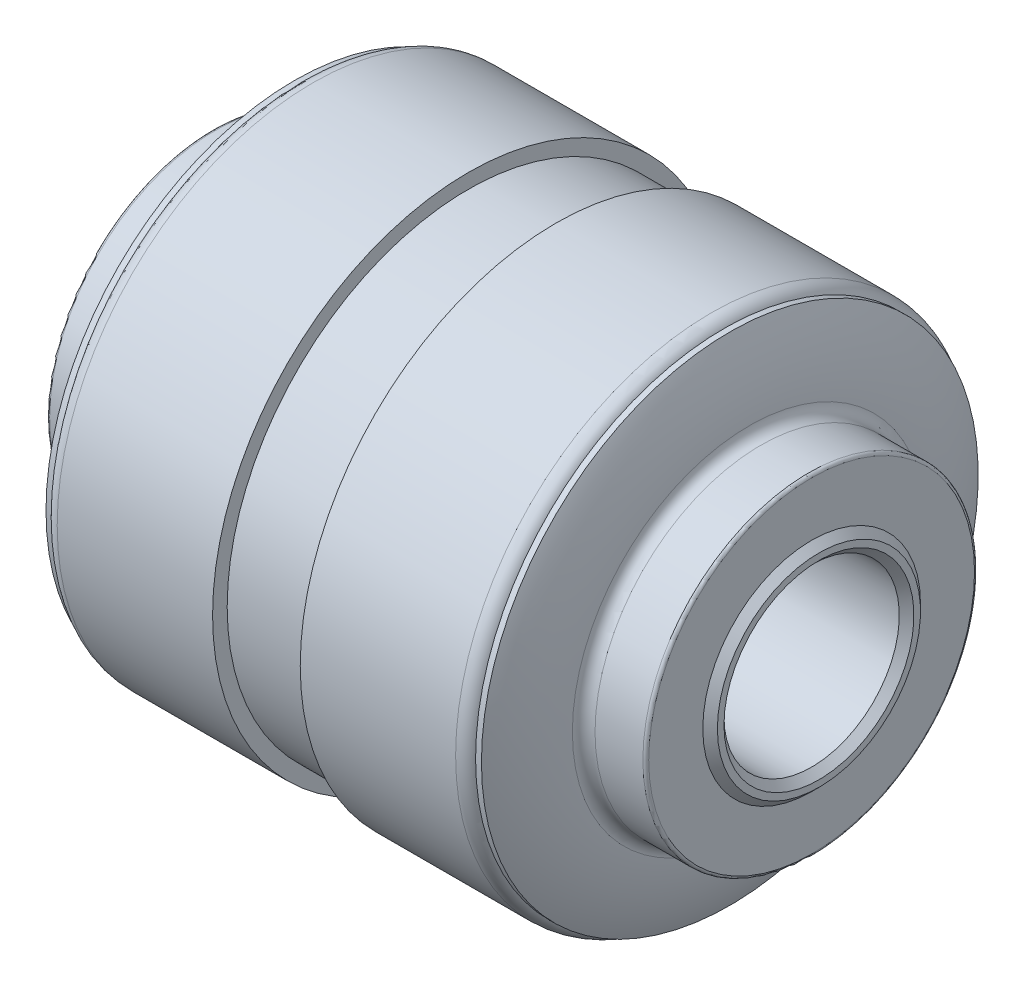
ISO-10303-21;
HEADER;
FILE_DESCRIPTION(('STEP AP214'),'2;1');
FILE_NAME('part.step','',(''),(''),'','','');
FILE_SCHEMA(('AUTOMOTIVE_DESIGN { 1 0 10303 214 1 1 1 1 }'));
ENDSEC;
DATA;
#1=APPLICATION_CONTEXT('core data for automotive mechanical design processes');
#2=APPLICATION_PROTOCOL_DEFINITION('international standard','automotive_design',2000,#1);
#3=PRODUCT_CONTEXT('',#1,'mechanical');
#4=PRODUCT('Part','Part','',(#3));
#5=PRODUCT_RELATED_PRODUCT_CATEGORY('part','',(#4));
#6=PRODUCT_DEFINITION_FORMATION('','',#4);
#7=PRODUCT_DEFINITION_CONTEXT('part definition',#1,'design');
#8=PRODUCT_DEFINITION('design','',#6,#7);
#9=PRODUCT_DEFINITION_SHAPE('','',#8);
#10=(LENGTH_UNIT() NAMED_UNIT(*) SI_UNIT(.MILLI.,.METRE.));
#11=(NAMED_UNIT(*) PLANE_ANGLE_UNIT() SI_UNIT($,.RADIAN.));
#12=(NAMED_UNIT(*) SI_UNIT($,.STERADIAN.) SOLID_ANGLE_UNIT());
#13=UNCERTAINTY_MEASURE_WITH_UNIT(LENGTH_MEASURE(1.E-05),#10,'distance_accuracy_value','');
#14=(GEOMETRIC_REPRESENTATION_CONTEXT(3) GLOBAL_UNCERTAINTY_ASSIGNED_CONTEXT((#13)) GLOBAL_UNIT_ASSIGNED_CONTEXT((#10,
#11,#12)) REPRESENTATION_CONTEXT('',''));
#15=CARTESIAN_POINT('',(0.,0.,0.));
#16=DIRECTION('',(0.,0.,1.));
#17=DIRECTION('',(1.,0.,0.));
#18=AXIS2_PLACEMENT_3D('',#15,#16,#17);
#19=CARTESIAN_POINT('',(88.99,0.,0.));
#20=DIRECTION('',(1.,0.,0.));
#21=DIRECTION('',(0.,0.,1.));
#22=AXIS2_PLACEMENT_3D('',#19,#20,#21);
#23=CYLINDRICAL_SURFACE('',#22,17.);
#24=CARTESIAN_POINT('',(-14.5,0.,0.));
#25=DIRECTION('',(-1.,0.,0.));
#26=DIRECTION('',(0.,0.,1.));
#27=AXIS2_PLACEMENT_3D('',#24,#25,#26);
#28=CIRCLE('',#27,17.);
#29=CARTESIAN_POINT('',(-14.5,0.,17.));
#30=VERTEX_POINT('',#29);
#31=EDGE_CURVE('E111',#30,#30,#28,.T.);
#32=ORIENTED_EDGE('',*,*,#31,.T.);
#33=EDGE_LOOP('',(#32));
#34=FACE_BOUND('',#33,.T.);
#35=CARTESIAN_POINT('',(-14.9002242129923,0.,0.));
#36=DIRECTION('',(1.,0.,0.));
#37=DIRECTION('',(0.,0.,-1.));
#38=AXIS2_PLACEMENT_3D('',#35,#36,#37);
#39=CIRCLE('',#38,17.);
#40=CARTESIAN_POINT('',(-14.9002242129923,0.,-17.));
#41=VERTEX_POINT('',#40);
#42=EDGE_CURVE('E90',#41,#41,#39,.F.);
#43=ORIENTED_EDGE('',*,*,#42,.F.);
#44=EDGE_LOOP('',(#43));
#45=FACE_BOUND('',#44,.T.);
#46=ADVANCED_FACE('F33',(#34,#45),#23,.T.);
#47=CARTESIAN_POINT('',(-88.99,0.,0.));
#48=DIRECTION('',(-1.,0.,0.));
#49=DIRECTION('',(0.,0.,1.));
#50=AXIS2_PLACEMENT_3D('',#47,#48,#49);
#51=CYLINDRICAL_SURFACE('',#50,17.);
#52=CARTESIAN_POINT('',(14.5,0.,0.));
#53=DIRECTION('',(-1.,0.,0.));
#54=DIRECTION('',(0.,0.,1.));
#55=AXIS2_PLACEMENT_3D('',#52,#53,#54);
#56=CIRCLE('',#55,17.);
#57=CARTESIAN_POINT('',(14.5,0.,17.));
#58=VERTEX_POINT('',#57);
#59=EDGE_CURVE('E101',#58,#58,#56,.T.);
#60=ORIENTED_EDGE('',*,*,#59,.F.);
#61=EDGE_LOOP('',(#60));
#62=FACE_BOUND('',#61,.T.);
#63=CARTESIAN_POINT('',(14.9002242129923,0.,0.));
#64=DIRECTION('',(-1.,0.,0.));
#65=DIRECTION('',(0.,0.,1.));
#66=AXIS2_PLACEMENT_3D('',#63,#64,#65);
#67=CIRCLE('',#66,17.);
#68=CARTESIAN_POINT('',(14.9002242129923,0.,17.));
#69=VERTEX_POINT('',#68);
#70=EDGE_CURVE('E94',#69,#69,#67,.F.);
#71=ORIENTED_EDGE('',*,*,#70,.F.);
#72=EDGE_LOOP('',(#71));
#73=FACE_BOUND('',#72,.T.);
#74=ADVANCED_FACE('F140',(#62,#73),#51,.T.);
#75=CARTESIAN_POINT('',(-88.99,0.,0.));
#76=DIRECTION('',(-1.,0.,0.));
#77=DIRECTION('',(0.,0.,1.));
#78=AXIS2_PLACEMENT_3D('',#75,#76,#77);
#79=CYLINDRICAL_SURFACE('',#78,6.);
#80=CARTESIAN_POINT('',(-20.5,0.,0.));
#81=DIRECTION('',(1.,0.,0.));
#82=DIRECTION('',(0.,0.,-1.));
#83=AXIS2_PLACEMENT_3D('',#80,#81,#82);
#84=CIRCLE('',#83,6.);
#85=CARTESIAN_POINT('',(-20.5,0.,-6.));
#86=VERTEX_POINT('',#85);
#87=EDGE_CURVE('E83',#86,#86,#84,.F.);
#88=ORIENTED_EDGE('',*,*,#87,.T.);
#89=EDGE_LOOP('',(#88));
#90=FACE_BOUND('',#89,.T.);
#91=CARTESIAN_POINT('',(20.5,0.,0.));
#92=DIRECTION('',(-1.,0.,0.));
#93=DIRECTION('',(0.,0.,1.));
#94=AXIS2_PLACEMENT_3D('',#91,#92,#93);
#95=CIRCLE('',#94,6.);
#96=CARTESIAN_POINT('',(20.5,0.,6.));
#97=VERTEX_POINT('',#96);
#98=EDGE_CURVE('E86',#97,#97,#95,.F.);
#99=ORIENTED_EDGE('',*,*,#98,.T.);
#100=EDGE_LOOP('',(#99));
#101=FACE_BOUND('',#100,.T.);
#102=ADVANCED_FACE('F146',(#90,#101),#79,.F.);
#103=CARTESIAN_POINT('',(21.,6.,0.));
#104=DIRECTION('',(-1.,0.,0.));
#105=DIRECTION('',(0.,0.,1.));
#106=AXIS2_PLACEMENT_3D('',#103,#104,#105);
#107=PLANE('',#106);
#108=CARTESIAN_POINT('',(21.,0.,0.));
#109=DIRECTION('',(-1.,0.,0.));
#110=DIRECTION('',(0.,0.,1.));
#111=AXIS2_PLACEMENT_3D('',#108,#109,#110);
#112=CIRCLE('',#111,6.49999999999999);
#113=CARTESIAN_POINT('',(21.,0.,6.49999999999999));
#114=VERTEX_POINT('',#113);
#115=EDGE_CURVE('E71',#114,#114,#112,.T.);
#116=ORIENTED_EDGE('',*,*,#115,.T.);
#117=EDGE_LOOP('',(#116));
#118=FACE_BOUND('',#117,.T.);
#119=CARTESIAN_POINT('',(21.,0.,0.));
#120=DIRECTION('',(-1.,0.,0.));
#121=DIRECTION('',(0.,0.,1.));
#122=AXIS2_PLACEMENT_3D('',#119,#120,#121);
#123=CIRCLE('',#122,6.94999999999999);
#124=CARTESIAN_POINT('',(21.,0.,6.94999999999999));
#125=VERTEX_POINT('',#124);
#126=EDGE_CURVE('E74',#125,#125,#123,.F.);
#127=ORIENTED_EDGE('',*,*,#126,.T.);
#128=EDGE_LOOP('',(#127));
#129=FACE_BOUND('',#128,.T.);
#130=ADVANCED_FACE('F321',(#118,#129),#107,.F.);
#131=CARTESIAN_POINT('',(20.5,7.45,0.));
#132=DIRECTION('',(-1.,0.,0.));
#133=DIRECTION('',(0.,0.,1.));
#134=AXIS2_PLACEMENT_3D('',#131,#132,#133);
#135=PLANE('',#134);
#136=CARTESIAN_POINT('',(20.5,0.,0.));
#137=DIRECTION('',(-1.,0.,0.));
#138=DIRECTION('',(0.,0.,1.));
#139=AXIS2_PLACEMENT_3D('',#136,#137,#138);
#140=CIRCLE('',#139,11.15);
#141=CARTESIAN_POINT('',(20.5,0.,11.15));
#142=VERTEX_POINT('',#141);
#143=EDGE_CURVE('E59',#142,#142,#140,.F.);
#144=ORIENTED_EDGE('',*,*,#143,.T.);
#145=EDGE_LOOP('',(#144));
#146=FACE_BOUND('',#145,.T.);
#147=CARTESIAN_POINT('',(20.5,0.,0.));
#148=DIRECTION('',(-1.,0.,0.));
#149=DIRECTION('',(0.,0.,1.));
#150=AXIS2_PLACEMENT_3D('',#147,#148,#149);
#151=CIRCLE('',#150,7.45);
#152=CARTESIAN_POINT('',(20.5,0.,7.45));
#153=VERTEX_POINT('',#152);
#154=EDGE_CURVE('E89',#153,#153,#151,.T.);
#155=ORIENTED_EDGE('',*,*,#154,.T.);
#156=EDGE_LOOP('',(#155));
#157=FACE_BOUND('',#156,.T.);
#158=ADVANCED_FACE('F293',(#146,#157),#135,.F.);
#159=CARTESIAN_POINT('',(-88.99,0.,0.));
#160=DIRECTION('',(-1.,0.,0.));
#161=DIRECTION('',(0.,0.,1.));
#162=AXIS2_PLACEMENT_3D('',#159,#160,#161);
#163=CYLINDRICAL_SURFACE('',#162,11.35);
#164=CARTESIAN_POINT('',(17.0259180473517,0.,0.));
#165=DIRECTION('',(-1.,0.,0.));
#166=DIRECTION('',(0.,0.,1.));
#167=AXIS2_PLACEMENT_3D('',#164,#165,#166);
#168=CIRCLE('',#167,11.35);
#169=CARTESIAN_POINT('',(17.0259180473517,0.,11.35));
#170=VERTEX_POINT('',#169);
#171=EDGE_CURVE('E44',#170,#170,#168,.F.);
#172=ORIENTED_EDGE('',*,*,#171,.T.);
#173=EDGE_LOOP('',(#172));
#174=FACE_BOUND('',#173,.T.);
#175=CARTESIAN_POINT('',(20.3,0.,0.));
#176=DIRECTION('',(-1.,0.,0.));
#177=DIRECTION('',(0.,0.,1.));
#178=AXIS2_PLACEMENT_3D('',#175,#176,#177);
#179=CIRCLE('',#178,11.35);
#180=CARTESIAN_POINT('',(20.3,0.,11.35));
#181=VERTEX_POINT('',#180);
#182=EDGE_CURVE('E62',#181,#181,#179,.T.);
#183=ORIENTED_EDGE('',*,*,#182,.T.);
#184=EDGE_LOOP('',(#183));
#185=FACE_BOUND('',#184,.T.);
#186=ADVANCED_FACE('F246',(#174,#185),#163,.T.);
#187=CARTESIAN_POINT('',(-88.99,0.,0.));
#188=DIRECTION('',(-1.,0.,0.));
#189=DIRECTION('',(0.,0.,1.));
#190=AXIS2_PLACEMENT_3D('',#187,#188,#189);
#191=CYLINDRICAL_SURFACE('',#190,17.5);
#192=CARTESIAN_POINT('',(13.6339745962156,0.,0.));
#193=DIRECTION('',(1.,0.,0.));
#194=DIRECTION('',(0.,0.,-1.));
#195=AXIS2_PLACEMENT_3D('',#192,#193,#194);
#196=CIRCLE('',#195,17.5);
#197=CARTESIAN_POINT('',(13.6339745962156,0.,-17.5));
#198=VERTEX_POINT('',#197);
#199=EDGE_CURVE('E40',#198,#198,#196,.F.);
#200=ORIENTED_EDGE('',*,*,#199,.T.);
#201=EDGE_LOOP('',(#200));
#202=FACE_BOUND('',#201,.T.);
#203=CARTESIAN_POINT('',(3.,0.,0.));
#204=DIRECTION('',(-1.,0.,0.));
#205=DIRECTION('',(0.,0.,1.));
#206=AXIS2_PLACEMENT_3D('',#203,#204,#205);
#207=CIRCLE('',#206,17.5);
#208=CARTESIAN_POINT('',(3.,0.,17.5));
#209=VERTEX_POINT('',#208);
#210=EDGE_CURVE('E104',#209,#209,#207,.T.);
#211=ORIENTED_EDGE('',*,*,#210,.F.);
#212=EDGE_LOOP('',(#211));
#213=FACE_BOUND('',#212,.T.);
#214=ADVANCED_FACE('F136',(#202,#213),#191,.T.);
#215=CARTESIAN_POINT('',(3.,17.5,0.));
#216=DIRECTION('',(1.,0.,0.));
#217=DIRECTION('',(0.,0.,-1.));
#218=AXIS2_PLACEMENT_3D('',#215,#216,#217);
#219=PLANE('',#218);
#220=CARTESIAN_POINT('',(3.,0.,0.));
#221=DIRECTION('',(-1.,0.,0.));
#222=DIRECTION('',(0.,0.,1.));
#223=AXIS2_PLACEMENT_3D('',#220,#221,#222);
#224=CIRCLE('',#223,16.5);
#225=CARTESIAN_POINT('',(3.,0.,16.5));
#226=VERTEX_POINT('',#225);
#227=EDGE_CURVE('E97',#226,#226,#224,.T.);
#228=ORIENTED_EDGE('',*,*,#227,.F.);
#229=EDGE_LOOP('',(#228));
#230=FACE_BOUND('',#229,.T.);
#231=ORIENTED_EDGE('',*,*,#210,.T.);
#232=EDGE_LOOP('',(#231));
#233=FACE_BOUND('',#232,.T.);
#234=ADVANCED_FACE('F126',(#230,#233),#219,.F.);
#235=CARTESIAN_POINT('',(-88.99,0.,0.));
#236=DIRECTION('',(-1.,0.,0.));
#237=DIRECTION('',(0.,0.,1.));
#238=AXIS2_PLACEMENT_3D('',#235,#236,#237);
#239=CYLINDRICAL_SURFACE('',#238,16.5);
#240=ORIENTED_EDGE('',*,*,#227,.T.);
#241=EDGE_LOOP('',(#240));
#242=FACE_BOUND('',#241,.T.);
#243=CARTESIAN_POINT('',(-3.,0.,0.));
#244=DIRECTION('',(-1.,0.,0.));
#245=DIRECTION('',(0.,0.,1.));
#246=AXIS2_PLACEMENT_3D('',#243,#244,#245);
#247=CIRCLE('',#246,16.5);
#248=CARTESIAN_POINT('',(-3.,0.,16.5));
#249=VERTEX_POINT('',#248);
#250=EDGE_CURVE('E93',#249,#249,#247,.T.);
#251=ORIENTED_EDGE('',*,*,#250,.F.);
#252=EDGE_LOOP('',(#251));
#253=FACE_BOUND('',#252,.T.);
#254=ADVANCED_FACE('F123',(#242,#253),#239,.T.);
#255=CARTESIAN_POINT('',(3.75,0.,0.));
#256=DIRECTION('',(-1.,0.,0.));
#257=DIRECTION('',(0.,0.,1.));
#258=AXIS2_PLACEMENT_3D('',#255,#256,#257);
#259=DEGENERATE_TOROIDAL_SURFACE('',#258,11.35,12.5,.T.);
#260=CARTESIAN_POINT('',(16.2273665858573,0.,0.));
#261=DIRECTION('',(-1.,0.,0.));
#262=DIRECTION('',(0.,0.,1.));
#263=AXIS2_PLACEMENT_3D('',#260,#261,#262);
#264=CIRCLE('',#263,12.1018796992481);
#265=CARTESIAN_POINT('',(16.2273665858573,0.,12.1018796992481));
#266=VERTEX_POINT('',#265);
#267=EDGE_CURVE('E48',#266,#266,#264,.T.);
#268=ORIENTED_EDGE('',*,*,#267,.T.);
#269=EDGE_LOOP('',(#268));
#270=FACE_BOUND('',#269,.T.);
#271=ORIENTED_EDGE('',*,*,#70,.T.);
#272=EDGE_LOOP('',(#271));
#273=FACE_BOUND('',#272,.T.);
#274=ADVANCED_FACE('F125',(#270,#273),#259,.T.);
#275=CARTESIAN_POINT('',(-21.,6.,0.));
#276=DIRECTION('',(1.,0.,0.));
#277=DIRECTION('',(0.,0.,1.));
#278=AXIS2_PLACEMENT_3D('',#275,#276,#277);
#279=PLANE('',#278);
#280=CARTESIAN_POINT('',(-21.,0.,0.));
#281=DIRECTION('',(1.,0.,0.));
#282=DIRECTION('',(0.,0.,-1.));
#283=AXIS2_PLACEMENT_3D('',#280,#281,#282);
#284=CIRCLE('',#283,6.5);
#285=CARTESIAN_POINT('',(-21.,0.,-6.5));
#286=VERTEX_POINT('',#285);
#287=EDGE_CURVE('E77',#286,#286,#284,.T.);
#288=ORIENTED_EDGE('',*,*,#287,.T.);
#289=EDGE_LOOP('',(#288));
#290=FACE_BOUND('',#289,.T.);
#291=CARTESIAN_POINT('',(-21.,0.,0.));
#292=DIRECTION('',(1.,0.,0.));
#293=DIRECTION('',(0.,0.,-1.));
#294=AXIS2_PLACEMENT_3D('',#291,#292,#293);
#295=CIRCLE('',#294,6.95);
#296=CARTESIAN_POINT('',(-21.,0.,-6.95));
#297=VERTEX_POINT('',#296);
#298=EDGE_CURVE('E80',#297,#297,#295,.F.);
#299=ORIENTED_EDGE('',*,*,#298,.T.);
#300=EDGE_LOOP('',(#299));
#301=FACE_BOUND('',#300,.T.);
#302=ADVANCED_FACE('F133',(#290,#301),#279,.F.);
#303=CARTESIAN_POINT('',(-20.5,7.45,0.));
#304=DIRECTION('',(1.,0.,0.));
#305=DIRECTION('',(0.,0.,1.));
#306=AXIS2_PLACEMENT_3D('',#303,#304,#305);
#307=PLANE('',#306);
#308=CARTESIAN_POINT('',(-20.5,0.,0.));
#309=DIRECTION('',(1.,0.,0.));
#310=DIRECTION('',(0.,0.,-1.));
#311=AXIS2_PLACEMENT_3D('',#308,#309,#310);
#312=CIRCLE('',#311,11.15);
#313=CARTESIAN_POINT('',(-20.5,0.,-11.15));
#314=VERTEX_POINT('',#313);
#315=EDGE_CURVE('E68',#314,#314,#312,.F.);
#316=ORIENTED_EDGE('',*,*,#315,.T.);
#317=EDGE_LOOP('',(#316));
#318=FACE_BOUND('',#317,.T.);
#319=CARTESIAN_POINT('',(-20.5,0.,0.));
#320=DIRECTION('',(-1.,0.,0.));
#321=DIRECTION('',(0.,0.,1.));
#322=AXIS2_PLACEMENT_3D('',#319,#320,#321);
#323=CIRCLE('',#322,7.45);
#324=CARTESIAN_POINT('',(-20.5,0.,7.45));
#325=VERTEX_POINT('',#324);
#326=EDGE_CURVE('E98',#325,#325,#323,.T.);
#327=ORIENTED_EDGE('',*,*,#326,.F.);
#328=EDGE_LOOP('',(#327));
#329=FACE_BOUND('',#328,.T.);
#330=ADVANCED_FACE('F157',(#318,#329),#307,.F.);
#331=CARTESIAN_POINT('',(88.99,0.,0.));
#332=DIRECTION('',(1.,0.,0.));
#333=DIRECTION('',(0.,0.,1.));
#334=AXIS2_PLACEMENT_3D('',#331,#332,#333);
#335=CYLINDRICAL_SURFACE('',#334,11.35);
#336=CARTESIAN_POINT('',(-17.0259180473517,0.,0.));
#337=DIRECTION('',(-1.,0.,0.));
#338=DIRECTION('',(0.,0.,1.));
#339=AXIS2_PLACEMENT_3D('',#336,#337,#338);
#340=CIRCLE('',#339,11.35);
#341=CARTESIAN_POINT('',(-17.0259180473517,0.,11.35));
#342=VERTEX_POINT('',#341);
#343=EDGE_CURVE('E56',#342,#342,#340,.T.);
#344=ORIENTED_EDGE('',*,*,#343,.T.);
#345=EDGE_LOOP('',(#344));
#346=FACE_BOUND('',#345,.T.);
#347=CARTESIAN_POINT('',(-20.3,0.,0.));
#348=DIRECTION('',(1.,0.,0.));
#349=DIRECTION('',(0.,0.,-1.));
#350=AXIS2_PLACEMENT_3D('',#347,#348,#349);
#351=CIRCLE('',#350,11.35);
#352=CARTESIAN_POINT('',(-20.3,0.,-11.35));
#353=VERTEX_POINT('',#352);
#354=EDGE_CURVE('E65',#353,#353,#351,.T.);
#355=ORIENTED_EDGE('',*,*,#354,.T.);
#356=EDGE_LOOP('',(#355));
#357=FACE_BOUND('',#356,.T.);
#358=ADVANCED_FACE('F154',(#346,#357),#335,.T.);
#359=CARTESIAN_POINT('',(88.99,0.,0.));
#360=DIRECTION('',(1.,0.,0.));
#361=DIRECTION('',(0.,0.,1.));
#362=AXIS2_PLACEMENT_3D('',#359,#360,#361);
#363=CYLINDRICAL_SURFACE('',#362,17.5);
#364=CARTESIAN_POINT('',(-13.6339745962156,0.,0.));
#365=DIRECTION('',(-1.,0.,0.));
#366=DIRECTION('',(0.,0.,1.));
#367=AXIS2_PLACEMENT_3D('',#364,#365,#366);
#368=CIRCLE('',#367,17.5);
#369=CARTESIAN_POINT('',(-13.6339745962156,0.,17.5));
#370=VERTEX_POINT('',#369);
#371=EDGE_CURVE('E11',#370,#370,#368,.F.);
#372=ORIENTED_EDGE('',*,*,#371,.T.);
#373=EDGE_LOOP('',(#372));
#374=FACE_BOUND('',#373,.T.);
#375=CARTESIAN_POINT('',(-3.,0.,0.));
#376=DIRECTION('',(-1.,0.,0.));
#377=DIRECTION('',(0.,0.,1.));
#378=AXIS2_PLACEMENT_3D('',#375,#376,#377);
#379=CIRCLE('',#378,17.5);
#380=CARTESIAN_POINT('',(-3.,0.,17.5));
#381=VERTEX_POINT('',#380);
#382=EDGE_CURVE('E114',#381,#381,#379,.T.);
#383=ORIENTED_EDGE('',*,*,#382,.T.);
#384=EDGE_LOOP('',(#383));
#385=FACE_BOUND('',#384,.T.);
#386=ADVANCED_FACE('F152',(#374,#385),#363,.T.);
#387=CARTESIAN_POINT('',(-3.,17.5,0.));
#388=DIRECTION('',(-1.,0.,0.));
#389=DIRECTION('',(0.,0.,-1.));
#390=AXIS2_PLACEMENT_3D('',#387,#388,#389);
#391=PLANE('',#390);
#392=ORIENTED_EDGE('',*,*,#250,.T.);
#393=EDGE_LOOP('',(#392));
#394=FACE_BOUND('',#393,.T.);
#395=ORIENTED_EDGE('',*,*,#382,.F.);
#396=EDGE_LOOP('',(#395));
#397=FACE_BOUND('',#396,.T.);
#398=ADVANCED_FACE('F120',(#394,#397),#391,.F.);
#399=CARTESIAN_POINT('',(-3.75,0.,0.));
#400=DIRECTION('',(1.,0.,0.));
#401=DIRECTION('',(0.,0.,1.));
#402=AXIS2_PLACEMENT_3D('',#399,#400,#401);
#403=DEGENERATE_TOROIDAL_SURFACE('',#402,11.35,12.5,.T.);
#404=CARTESIAN_POINT('',(-16.2273665858573,0.,0.));
#405=DIRECTION('',(1.,0.,0.));
#406=DIRECTION('',(0.,0.,-1.));
#407=AXIS2_PLACEMENT_3D('',#404,#405,#406);
#408=CIRCLE('',#407,12.1018796992481);
#409=CARTESIAN_POINT('',(-16.2273665858573,0.,-12.1018796992481));
#410=VERTEX_POINT('',#409);
#411=EDGE_CURVE('E53',#410,#410,#408,.T.);
#412=ORIENTED_EDGE('',*,*,#411,.T.);
#413=EDGE_LOOP('',(#412));
#414=FACE_BOUND('',#413,.T.);
#415=ORIENTED_EDGE('',*,*,#42,.T.);
#416=EDGE_LOOP('',(#415));
#417=FACE_BOUND('',#416,.T.);
#418=ADVANCED_FACE('F183',(#414,#417),#403,.T.);
#419=CARTESIAN_POINT('',(-20.5,0.,0.));
#420=DIRECTION('',(-1.,0.,0.));
#421=DIRECTION('',(0.,0.,1.));
#422=AXIS2_PLACEMENT_3D('',#419,#420,#421);
#423=CONICAL_SURFACE('',#422,6.,0.785398163397447);
#424=ORIENTED_EDGE('',*,*,#287,.F.);
#425=EDGE_LOOP('',(#424));
#426=FACE_BOUND('',#425,.T.);
#427=ORIENTED_EDGE('',*,*,#87,.F.);
#428=EDGE_LOOP('',(#427));
#429=FACE_BOUND('',#428,.T.);
#430=ADVANCED_FACE('F173',(#426,#429),#423,.F.);
#431=CARTESIAN_POINT('',(-21.,0.,0.));
#432=DIRECTION('',(1.,0.,0.));
#433=DIRECTION('',(0.,0.,-1.));
#434=AXIS2_PLACEMENT_3D('',#431,#432,#433);
#435=CONICAL_SURFACE('',#434,6.95,0.78539816339745);
#436=ORIENTED_EDGE('',*,*,#326,.T.);
#437=EDGE_LOOP('',(#436));
#438=FACE_BOUND('',#437,.T.);
#439=ORIENTED_EDGE('',*,*,#298,.F.);
#440=EDGE_LOOP('',(#439));
#441=FACE_BOUND('',#440,.T.);
#442=ADVANCED_FACE('F170',(#438,#441),#435,.T.);
#443=CARTESIAN_POINT('',(21.,0.,0.));
#444=DIRECTION('',(1.,0.,0.));
#445=DIRECTION('',(0.,0.,-1.));
#446=AXIS2_PLACEMENT_3D('',#443,#444,#445);
#447=CONICAL_SURFACE('',#446,6.5,0.785398163397446);
#448=ORIENTED_EDGE('',*,*,#98,.F.);
#449=EDGE_LOOP('',(#448));
#450=FACE_BOUND('',#449,.T.);
#451=ORIENTED_EDGE('',*,*,#115,.F.);
#452=EDGE_LOOP('',(#451));
#453=FACE_BOUND('',#452,.T.);
#454=ADVANCED_FACE('F172',(#450,#453),#447,.F.);
#455=CARTESIAN_POINT('',(20.5,0.,0.));
#456=DIRECTION('',(-1.,0.,0.));
#457=DIRECTION('',(0.,0.,1.));
#458=AXIS2_PLACEMENT_3D('',#455,#456,#457);
#459=CONICAL_SURFACE('',#458,7.45,0.78539816339745);
#460=ORIENTED_EDGE('',*,*,#126,.F.);
#461=EDGE_LOOP('',(#460));
#462=FACE_BOUND('',#461,.T.);
#463=ORIENTED_EDGE('',*,*,#154,.F.);
#464=EDGE_LOOP('',(#463));
#465=FACE_BOUND('',#464,.T.);
#466=ADVANCED_FACE('F180',(#462,#465),#459,.T.);
#467=CARTESIAN_POINT('',(-20.3,0.,0.));
#468=DIRECTION('',(1.,0.,0.));
#469=DIRECTION('',(0.,0.,-1.));
#470=AXIS2_PLACEMENT_3D('',#467,#468,#469);
#471=TOROIDAL_SURFACE('',#470,11.15,0.2);
#472=ORIENTED_EDGE('',*,*,#354,.F.);
#473=EDGE_LOOP('',(#472));
#474=FACE_BOUND('',#473,.T.);
#475=ORIENTED_EDGE('',*,*,#315,.F.);
#476=EDGE_LOOP('',(#475));
#477=FACE_BOUND('',#476,.T.);
#478=ADVANCED_FACE('F190',(#474,#477),#471,.T.);
#479=CARTESIAN_POINT('',(20.3,0.,0.));
#480=DIRECTION('',(-1.,0.,0.));
#481=DIRECTION('',(0.,0.,1.));
#482=AXIS2_PLACEMENT_3D('',#479,#480,#481);
#483=TOROIDAL_SURFACE('',#482,11.15,0.2);
#484=ORIENTED_EDGE('',*,*,#143,.F.);
#485=EDGE_LOOP('',(#484));
#486=FACE_BOUND('',#485,.T.);
#487=ORIENTED_EDGE('',*,*,#182,.F.);
#488=EDGE_LOOP('',(#487));
#489=FACE_BOUND('',#488,.T.);
#490=ADVANCED_FACE('F194',(#486,#489),#483,.T.);
#491=CARTESIAN_POINT('',(-17.0259180473518,0.,0.));
#492=DIRECTION('',(-1.,0.,0.));
#493=DIRECTION('',(0.,0.,1.));
#494=AXIS2_PLACEMENT_3D('',#491,#492,#493);
#495=TOROIDAL_SURFACE('',#494,12.15,0.8);
#496=ORIENTED_EDGE('',*,*,#411,.F.);
#497=EDGE_LOOP('',(#496));
#498=FACE_BOUND('',#497,.T.);
#499=ORIENTED_EDGE('',*,*,#343,.F.);
#500=EDGE_LOOP('',(#499));
#501=FACE_BOUND('',#500,.T.);
#502=ADVANCED_FACE('F198',(#498,#501),#495,.F.);
#503=CARTESIAN_POINT('',(17.0259180473518,0.,0.));
#504=DIRECTION('',(-1.,0.,0.));
#505=DIRECTION('',(0.,0.,1.));
#506=AXIS2_PLACEMENT_3D('',#503,#504,#505);
#507=TOROIDAL_SURFACE('',#506,12.15,0.8);
#508=ORIENTED_EDGE('',*,*,#171,.F.);
#509=EDGE_LOOP('',(#508));
#510=FACE_BOUND('',#509,.T.);
#511=ORIENTED_EDGE('',*,*,#267,.F.);
#512=EDGE_LOOP('',(#511));
#513=FACE_BOUND('',#512,.T.);
#514=ADVANCED_FACE('F202',(#510,#513),#507,.F.);
#515=CARTESIAN_POINT('',(13.6339745962156,0.,0.));
#516=DIRECTION('',(1.,0.,0.));
#517=DIRECTION('',(0.,0.,-1.));
#518=AXIS2_PLACEMENT_3D('',#515,#516,#517);
#519=TOROIDAL_SURFACE('',#518,16.5,1.);
#520=ORIENTED_EDGE('',*,*,#59,.T.);
#521=EDGE_LOOP('',(#520));
#522=FACE_BOUND('',#521,.T.);
#523=ORIENTED_EDGE('',*,*,#199,.F.);
#524=EDGE_LOOP('',(#523));
#525=FACE_BOUND('',#524,.T.);
#526=ADVANCED_FACE('F205',(#522,#525),#519,.T.);
#527=CARTESIAN_POINT('',(-13.6339745962156,0.,0.));
#528=DIRECTION('',(-1.,0.,0.));
#529=DIRECTION('',(0.,0.,1.));
#530=AXIS2_PLACEMENT_3D('',#527,#528,#529);
#531=TOROIDAL_SURFACE('',#530,16.5,1.);
#532=ORIENTED_EDGE('',*,*,#371,.F.);
#533=EDGE_LOOP('',(#532));
#534=FACE_BOUND('',#533,.T.);
#535=ORIENTED_EDGE('',*,*,#31,.F.);
#536=EDGE_LOOP('',(#535));
#537=FACE_BOUND('',#536,.T.);
#538=ADVANCED_FACE('F35',(#534,#537),#531,.T.);
#539=CLOSED_SHELL('',(#46,#74,#102,#130,#158,#186,#214,#234,#254,#274,#302,#330,#358,#386,#398,
#418,#430,#442,#454,#466,#478,#490,#502,#514,#526,#538));
#540=MANIFOLD_SOLID_BREP('B2',#539);
#541=ADVANCED_BREP_SHAPE_REPRESENTATION('',(#18,#540),#14);
#542=SHAPE_DEFINITION_REPRESENTATION(#9,#541);
ENDSEC;
END-ISO-10303-21;
